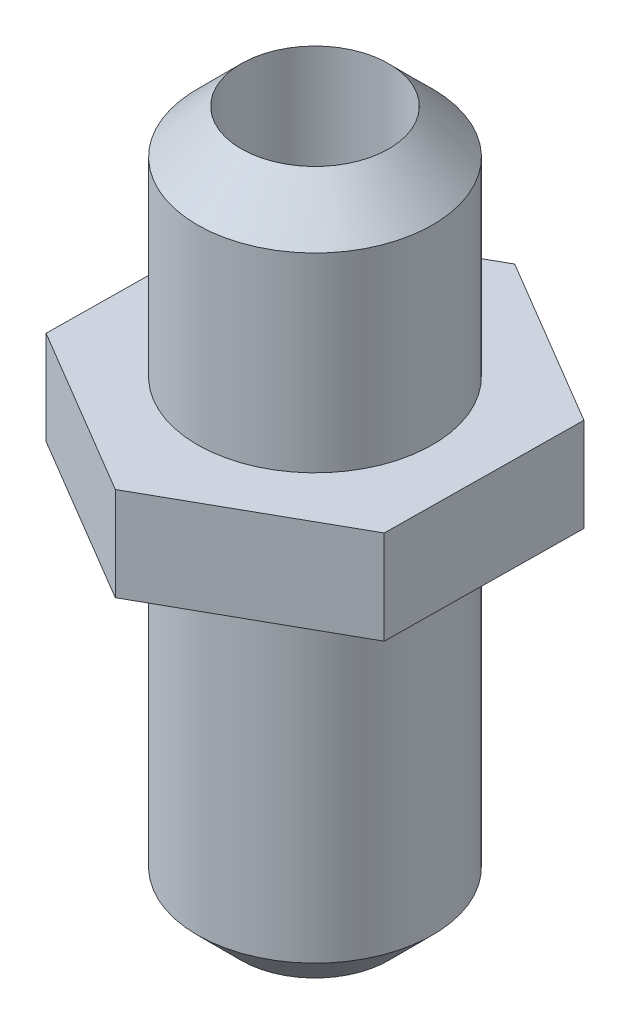
ISO-10303-21;
HEADER;
FILE_DESCRIPTION(('STEP AP214'),'2;1');
FILE_NAME('part.step','',(''),(''),'','','');
FILE_SCHEMA(('AUTOMOTIVE_DESIGN { 1 0 10303 214 1 1 1 1 }'));
ENDSEC;
DATA;
#1=APPLICATION_CONTEXT('core data for automotive mechanical design processes');
#2=APPLICATION_PROTOCOL_DEFINITION('international standard','automotive_design',2000,#1);
#3=PRODUCT_CONTEXT('',#1,'mechanical');
#4=PRODUCT('Part','Part','',(#3));
#5=PRODUCT_RELATED_PRODUCT_CATEGORY('part','',(#4));
#6=PRODUCT_DEFINITION_FORMATION('','',#4);
#7=PRODUCT_DEFINITION_CONTEXT('part definition',#1,'design');
#8=PRODUCT_DEFINITION('design','',#6,#7);
#9=PRODUCT_DEFINITION_SHAPE('','',#8);
#10=(LENGTH_UNIT() NAMED_UNIT(*) SI_UNIT(.MILLI.,.METRE.));
#11=(NAMED_UNIT(*) PLANE_ANGLE_UNIT() SI_UNIT($,.RADIAN.));
#12=(NAMED_UNIT(*) SI_UNIT($,.STERADIAN.) SOLID_ANGLE_UNIT());
#13=UNCERTAINTY_MEASURE_WITH_UNIT(LENGTH_MEASURE(1.E-05),#10,'distance_accuracy_value','');
#14=(GEOMETRIC_REPRESENTATION_CONTEXT(3) GLOBAL_UNCERTAINTY_ASSIGNED_CONTEXT((#13)) GLOBAL_UNIT_ASSIGNED_CONTEXT((#10,
#11,#12)) REPRESENTATION_CONTEXT('',''));
#15=CARTESIAN_POINT('',(0.,0.,0.));
#16=DIRECTION('',(0.,0.,1.));
#17=DIRECTION('',(1.,0.,0.));
#18=AXIS2_PLACEMENT_3D('',#15,#16,#17);
#19=CARTESIAN_POINT('',(4.54424241698549,5.08,8.08092209191937));
#20=DIRECTION('',(-0.490156662386525,0.,-0.871634353566966));
#21=DIRECTION('',(-0.871634353566966,0.,0.490156662386525));
#22=AXIS2_PLACEMENT_3D('',#19,#20,#21);
#23=PLANE('',#22);
#24=DIRECTION('',(0.871634353566966,0.,-0.490156662386525));
#25=VECTOR('',#24,1.);
#26=CARTESIAN_POINT('',(4.54424241698549,0.,8.08092209191937));
#27=LINE('',#26,#25);
#28=CARTESIAN_POINT('',(-0.121280128084548,0.,10.7045416746289));
#29=VERTEX_POINT('',#28);
#30=CARTESIAN_POINT('',(9.20976496205554,0.,5.45730250920989));
#31=VERTEX_POINT('',#30);
#32=EDGE_CURVE('E152',#29,#31,#27,.T.);
#33=ORIENTED_EDGE('',*,*,#32,.T.);
#34=DIRECTION('',(0.,-1.,0.));
#35=VECTOR('',#34,1.);
#36=CARTESIAN_POINT('',(9.20976496205554,5.08,5.45730250920989));
#37=LINE('',#36,#35);
#38=CARTESIAN_POINT('',(9.20976496205554,5.08,5.45730250920989));
#39=VERTEX_POINT('',#38);
#40=EDGE_CURVE('E164',#39,#31,#37,.T.);
#41=ORIENTED_EDGE('',*,*,#40,.F.);
#42=DIRECTION('',(0.871634353566966,0.,-0.490156662386525));
#43=VECTOR('',#42,1.);
#44=CARTESIAN_POINT('',(4.54424241698549,5.08,8.08092209191937));
#45=LINE('',#44,#43);
#46=CARTESIAN_POINT('',(-0.121280128084548,5.08,10.7045416746289));
#47=VERTEX_POINT('',#46);
#48=EDGE_CURVE('E118',#47,#39,#45,.T.);
#49=ORIENTED_EDGE('',*,*,#48,.F.);
#50=DIRECTION('',(0.,-1.,0.));
#51=VECTOR('',#50,1.);
#52=CARTESIAN_POINT('',(-0.121280128084548,5.08,10.7045416746289));
#53=LINE('',#52,#51);
#54=EDGE_CURVE('E167',#47,#29,#53,.T.);
#55=ORIENTED_EDGE('',*,*,#54,.T.);
#56=EDGE_LOOP('',(#33,#41,#49,#55));
#57=FACE_BOUND('',#56,.T.);
#58=ADVANCED_FACE('F62',(#57),#23,.F.);
#59=CARTESIAN_POINT('',(9.27040502609781,5.08,0.105031671895452));
#60=DIRECTION('',(-0.999935824193482,0.,-0.0113290553225598));
#61=DIRECTION('',(-0.0113290553225598,0.,0.999935824193482));
#62=AXIS2_PLACEMENT_3D('',#59,#60,#61);
#63=PLANE('',#62);
#64=DIRECTION('',(0.0113290553225598,0.,-0.999935824193482));
#65=VECTOR('',#64,1.);
#66=CARTESIAN_POINT('',(9.27040502609781,0.,0.105031671895452));
#67=LINE('',#66,#65);
#68=CARTESIAN_POINT('',(9.33104509014009,0.,-5.24723916541898));
#69=VERTEX_POINT('',#68);
#70=EDGE_CURVE('E155',#31,#69,#67,.T.);
#71=ORIENTED_EDGE('',*,*,#70,.T.);
#72=DIRECTION('',(0.,-1.,0.));
#73=VECTOR('',#72,1.);
#74=CARTESIAN_POINT('',(9.33104509014009,5.08,-5.24723916541898));
#75=LINE('',#74,#73);
#76=CARTESIAN_POINT('',(9.33104509014009,5.08,-5.24723916541898));
#77=VERTEX_POINT('',#76);
#78=EDGE_CURVE('E140',#77,#69,#75,.T.);
#79=ORIENTED_EDGE('',*,*,#78,.F.);
#80=DIRECTION('',(0.0113290553225598,0.,-0.999935824193482));
#81=VECTOR('',#80,1.);
#82=CARTESIAN_POINT('',(9.27040502609781,5.08,0.105031671895452));
#83=LINE('',#82,#81);
#84=EDGE_CURVE('E131',#39,#77,#83,.T.);
#85=ORIENTED_EDGE('',*,*,#84,.F.);
#86=ORIENTED_EDGE('',*,*,#40,.T.);
#87=EDGE_LOOP('',(#71,#79,#85,#86));
#88=FACE_BOUND('',#87,.T.);
#89=ADVANCED_FACE('F197',(#88),#63,.F.);
#90=CARTESIAN_POINT('',(4.72616260911232,5.08,-7.97589042002392));
#91=DIRECTION('',(-0.509779161806957,0.,0.860305298244406));
#92=DIRECTION('',(0.860305298244406,0.,0.509779161806957));
#93=AXIS2_PLACEMENT_3D('',#90,#91,#92);
#94=PLANE('',#93);
#95=DIRECTION('',(-0.860305298244406,0.,-0.509779161806957));
#96=VECTOR('',#95,1.);
#97=CARTESIAN_POINT('',(4.72616260911232,0.,-7.97589042002392));
#98=LINE('',#97,#96);
#99=CARTESIAN_POINT('',(0.121280128084553,0.,-10.7045416746289));
#100=VERTEX_POINT('',#99);
#101=EDGE_CURVE('E139',#69,#100,#98,.T.);
#102=ORIENTED_EDGE('',*,*,#101,.T.);
#103=DIRECTION('',(0.,-1.,0.));
#104=VECTOR('',#103,1.);
#105=CARTESIAN_POINT('',(0.121280128084553,5.08,-10.7045416746289));
#106=LINE('',#105,#104);
#107=CARTESIAN_POINT('',(0.121280128084553,5.08,-10.7045416746289));
#108=VERTEX_POINT('',#107);
#109=EDGE_CURVE('E136',#108,#100,#106,.T.);
#110=ORIENTED_EDGE('',*,*,#109,.F.);
#111=DIRECTION('',(-0.860305298244406,0.,-0.509779161806957));
#112=VECTOR('',#111,1.);
#113=CARTESIAN_POINT('',(4.72616260911232,5.08,-7.97589042002392));
#114=LINE('',#113,#112);
#115=EDGE_CURVE('E125',#77,#108,#114,.T.);
#116=ORIENTED_EDGE('',*,*,#115,.F.);
#117=ORIENTED_EDGE('',*,*,#78,.T.);
#118=EDGE_LOOP('',(#102,#110,#116,#117));
#119=FACE_BOUND('',#118,.T.);
#120=ADVANCED_FACE('F137',(#119),#94,.F.);
#121=CARTESIAN_POINT('',(-4.54424241698549,5.08,-8.08092209191937));
#122=DIRECTION('',(0.490156662386525,0.,0.871634353566966));
#123=DIRECTION('',(0.871634353566966,0.,-0.490156662386525));
#124=AXIS2_PLACEMENT_3D('',#121,#122,#123);
#125=PLANE('',#124);
#126=DIRECTION('',(-0.871634353566966,0.,0.490156662386525));
#127=VECTOR('',#126,1.);
#128=CARTESIAN_POINT('',(-4.54424241698549,0.,-8.08092209191937));
#129=LINE('',#128,#127);
#130=CARTESIAN_POINT('',(-9.20976496205553,0.,-5.45730250920989));
#131=VERTEX_POINT('',#130);
#132=EDGE_CURVE('E103',#100,#131,#129,.T.);
#133=ORIENTED_EDGE('',*,*,#132,.T.);
#134=DIRECTION('',(0.,-1.,0.));
#135=VECTOR('',#134,1.);
#136=CARTESIAN_POINT('',(-9.20976496205553,5.08,-5.45730250920989));
#137=LINE('',#136,#135);
#138=CARTESIAN_POINT('',(-9.20976496205553,5.08,-5.45730250920989));
#139=VERTEX_POINT('',#138);
#140=EDGE_CURVE('E141',#139,#131,#137,.T.);
#141=ORIENTED_EDGE('',*,*,#140,.F.);
#142=DIRECTION('',(-0.871634353566966,0.,0.490156662386525));
#143=VECTOR('',#142,1.);
#144=CARTESIAN_POINT('',(-4.54424241698549,5.08,-8.08092209191937));
#145=LINE('',#144,#143);
#146=EDGE_CURVE('E129',#108,#139,#145,.T.);
#147=ORIENTED_EDGE('',*,*,#146,.F.);
#148=ORIENTED_EDGE('',*,*,#109,.T.);
#149=EDGE_LOOP('',(#133,#141,#147,#148));
#150=FACE_BOUND('',#149,.T.);
#151=ADVANCED_FACE('F143',(#150),#125,.F.);
#152=CARTESIAN_POINT('',(-9.27040502609781,5.08,-0.10503167189545));
#153=DIRECTION('',(0.999935824193482,0.,0.0113290553225596));
#154=DIRECTION('',(0.0113290553225596,0.,-0.999935824193482));
#155=AXIS2_PLACEMENT_3D('',#152,#153,#154);
#156=PLANE('',#155);
#157=DIRECTION('',(-0.0113290553225596,0.,0.999935824193482));
#158=VECTOR('',#157,1.);
#159=CARTESIAN_POINT('',(-9.27040502609781,0.,-0.10503167189545));
#160=LINE('',#159,#158);
#161=CARTESIAN_POINT('',(-9.33104509014008,0.,5.24723916541898));
#162=VERTEX_POINT('',#161);
#163=EDGE_CURVE('E109',#131,#162,#160,.T.);
#164=ORIENTED_EDGE('',*,*,#163,.T.);
#165=DIRECTION('',(0.,-1.,0.));
#166=VECTOR('',#165,1.);
#167=CARTESIAN_POINT('',(-9.33104509014008,5.08,5.24723916541898));
#168=LINE('',#167,#166);
#169=CARTESIAN_POINT('',(-9.33104509014008,5.08,5.24723916541898));
#170=VERTEX_POINT('',#169);
#171=EDGE_CURVE('E145',#170,#162,#168,.T.);
#172=ORIENTED_EDGE('',*,*,#171,.F.);
#173=DIRECTION('',(-0.0113290553225596,0.,0.999935824193482));
#174=VECTOR('',#173,1.);
#175=CARTESIAN_POINT('',(-9.27040502609781,5.08,-0.10503167189545));
#176=LINE('',#175,#174);
#177=EDGE_CURVE('E80',#139,#170,#176,.T.);
#178=ORIENTED_EDGE('',*,*,#177,.F.);
#179=ORIENTED_EDGE('',*,*,#140,.T.);
#180=EDGE_LOOP('',(#164,#172,#178,#179));
#181=FACE_BOUND('',#180,.T.);
#182=ADVANCED_FACE('F203',(#181),#156,.F.);
#183=CARTESIAN_POINT('',(-4.72616260911232,5.08,7.97589042002392));
#184=DIRECTION('',(0.509779161806957,0.,-0.860305298244406));
#185=DIRECTION('',(-0.860305298244406,0.,-0.509779161806957));
#186=AXIS2_PLACEMENT_3D('',#183,#184,#185);
#187=PLANE('',#186);
#188=DIRECTION('',(0.860305298244406,0.,0.509779161806957));
#189=VECTOR('',#188,1.);
#190=CARTESIAN_POINT('',(-4.72616260911232,0.,7.97589042002392));
#191=LINE('',#190,#189);
#192=EDGE_CURVE('E149',#162,#29,#191,.T.);
#193=ORIENTED_EDGE('',*,*,#192,.T.);
#194=ORIENTED_EDGE('',*,*,#54,.F.);
#195=DIRECTION('',(0.860305298244406,0.,0.509779161806957));
#196=VECTOR('',#195,1.);
#197=CARTESIAN_POINT('',(-4.72616260911232,5.08,7.97589042002392));
#198=LINE('',#197,#196);
#199=EDGE_CURVE('E160',#170,#47,#198,.T.);
#200=ORIENTED_EDGE('',*,*,#199,.F.);
#201=ORIENTED_EDGE('',*,*,#171,.T.);
#202=EDGE_LOOP('',(#193,#194,#200,#201));
#203=FACE_BOUND('',#202,.T.);
#204=ADVANCED_FACE('F202',(#203),#187,.F.);
#205=CARTESIAN_POINT('',(0.,0.,0.));
#206=DIRECTION('',(0.,1.,0.));
#207=DIRECTION('',(0.,0.,1.));
#208=AXIS2_PLACEMENT_3D('',#205,#206,#207);
#209=PLANE('',#208);
#210=CARTESIAN_POINT('',(0.,0.,0.));
#211=DIRECTION('',(0.,1.,0.));
#212=DIRECTION('',(0.,0.,1.));
#213=AXIS2_PLACEMENT_3D('',#210,#211,#212);
#214=CIRCLE('',#213,6.38048);
#215=CARTESIAN_POINT('',(0.,0.,6.38048));
#216=VERTEX_POINT('',#215);
#217=EDGE_CURVE('E171',#216,#216,#214,.T.);
#218=ORIENTED_EDGE('',*,*,#217,.T.);
#219=EDGE_LOOP('',(#218));
#220=FACE_BOUND('',#219,.T.);
#221=ORIENTED_EDGE('',*,*,#192,.F.);
#222=ORIENTED_EDGE('',*,*,#163,.F.);
#223=ORIENTED_EDGE('',*,*,#132,.F.);
#224=ORIENTED_EDGE('',*,*,#101,.F.);
#225=ORIENTED_EDGE('',*,*,#70,.F.);
#226=ORIENTED_EDGE('',*,*,#32,.F.);
#227=EDGE_LOOP('',(#221,#222,#223,#224,#225,#226));
#228=FACE_BOUND('',#227,.T.);
#229=ADVANCED_FACE('F200',(#220,#228),#209,.F.);
#230=CARTESIAN_POINT('',(0.,5.08,0.));
#231=DIRECTION('',(0.,1.,0.));
#232=DIRECTION('',(0.,0.,1.));
#233=AXIS2_PLACEMENT_3D('',#230,#231,#232);
#234=PLANE('',#233);
#235=CARTESIAN_POINT('',(0.,5.08,0.));
#236=DIRECTION('',(0.,1.,0.));
#237=DIRECTION('',(0.,0.,1.));
#238=AXIS2_PLACEMENT_3D('',#235,#236,#237);
#239=CIRCLE('',#238,6.38048);
#240=CARTESIAN_POINT('',(0.,5.08,6.38048));
#241=VERTEX_POINT('',#240);
#242=EDGE_CURVE('E153',#241,#241,#239,.F.);
#243=ORIENTED_EDGE('',*,*,#242,.T.);
#244=EDGE_LOOP('',(#243));
#245=FACE_BOUND('',#244,.T.);
#246=ORIENTED_EDGE('',*,*,#199,.T.);
#247=ORIENTED_EDGE('',*,*,#48,.T.);
#248=ORIENTED_EDGE('',*,*,#84,.T.);
#249=ORIENTED_EDGE('',*,*,#115,.T.);
#250=ORIENTED_EDGE('',*,*,#146,.T.);
#251=ORIENTED_EDGE('',*,*,#177,.T.);
#252=EDGE_LOOP('',(#246,#247,#248,#249,#250,#251));
#253=FACE_BOUND('',#252,.T.);
#254=ADVANCED_FACE('F127',(#245,#253),#234,.T.);
#255=CARTESIAN_POINT('',(0.,17.78,0.));
#256=DIRECTION('',(0.,-1.,0.));
#257=DIRECTION('',(0.,0.,-1.));
#258=AXIS2_PLACEMENT_3D('',#255,#256,#257);
#259=CYLINDRICAL_SURFACE('',#258,6.38048);
#260=CARTESIAN_POINT('',(0.,15.4,0.));
#261=DIRECTION('',(0.,1.,0.));
#262=DIRECTION('',(0.,0.,1.));
#263=AXIS2_PLACEMENT_3D('',#260,#261,#262);
#264=CIRCLE('',#263,6.38048);
#265=CARTESIAN_POINT('',(0.,15.4,6.38048));
#266=VERTEX_POINT('',#265);
#267=EDGE_CURVE('E72',#266,#266,#264,.F.);
#268=ORIENTED_EDGE('',*,*,#267,.T.);
#269=EDGE_LOOP('',(#268));
#270=FACE_BOUND('',#269,.T.);
#271=ORIENTED_EDGE('',*,*,#242,.F.);
#272=EDGE_LOOP('',(#271));
#273=FACE_BOUND('',#272,.T.);
#274=ADVANCED_FACE('F178',(#270,#273),#259,.T.);
#275=CARTESIAN_POINT('',(0.,-20.32,0.));
#276=DIRECTION('',(0.,1.,0.));
#277=DIRECTION('',(0.,0.,1.));
#278=AXIS2_PLACEMENT_3D('',#275,#276,#277);
#279=CYLINDRICAL_SURFACE('',#278,6.38048);
#280=CARTESIAN_POINT('',(0.,-17.94,0.));
#281=DIRECTION('',(0.,1.,0.));
#282=DIRECTION('',(0.,0.,1.));
#283=AXIS2_PLACEMENT_3D('',#280,#281,#282);
#284=CIRCLE('',#283,6.38048);
#285=CARTESIAN_POINT('',(0.,-17.94,6.38048));
#286=VERTEX_POINT('',#285);
#287=EDGE_CURVE('E12',#286,#286,#284,.T.);
#288=ORIENTED_EDGE('',*,*,#287,.T.);
#289=EDGE_LOOP('',(#288));
#290=FACE_BOUND('',#289,.T.);
#291=ORIENTED_EDGE('',*,*,#217,.F.);
#292=EDGE_LOOP('',(#291));
#293=FACE_BOUND('',#292,.T.);
#294=ADVANCED_FACE('F272',(#290,#293),#279,.T.);
#295=CARTESIAN_POINT('',(0.,-32.512,0.));
#296=DIRECTION('',(0.,1.,0.));
#297=DIRECTION('',(0.,0.,1.));
#298=AXIS2_PLACEMENT_3D('',#295,#296,#297);
#299=CYLINDRICAL_SURFACE('',#298,4.00047968);
#300=CARTESIAN_POINT('',(0.,17.78,0.));
#301=DIRECTION('',(0.,1.,0.));
#302=DIRECTION('',(0.,0.,1.));
#303=AXIS2_PLACEMENT_3D('',#300,#301,#302);
#304=CIRCLE('',#303,4.00047968);
#305=CARTESIAN_POINT('',(0.,17.78,4.00047968));
#306=VERTEX_POINT('',#305);
#307=EDGE_CURVE('E174',#306,#306,#304,.T.);
#308=ORIENTED_EDGE('',*,*,#307,.T.);
#309=EDGE_LOOP('',(#308));
#310=FACE_BOUND('',#309,.T.);
#311=CARTESIAN_POINT('',(0.,-20.32,0.));
#312=DIRECTION('',(0.,1.,0.));
#313=DIRECTION('',(0.,0.,1.));
#314=AXIS2_PLACEMENT_3D('',#311,#312,#313);
#315=CIRCLE('',#314,4.00047968);
#316=CARTESIAN_POINT('',(0.,-20.32,4.00047968));
#317=VERTEX_POINT('',#316);
#318=EDGE_CURVE('E172',#317,#317,#315,.T.);
#319=ORIENTED_EDGE('',*,*,#318,.F.);
#320=EDGE_LOOP('',(#319));
#321=FACE_BOUND('',#320,.T.);
#322=ADVANCED_FACE('F184',(#310,#321),#299,.F.);
#323=CARTESIAN_POINT('',(0.,17.78,0.));
#324=DIRECTION('',(0.,-1.,0.));
#325=DIRECTION('',(0.,0.,-1.));
#326=AXIS2_PLACEMENT_3D('',#323,#324,#325);
#327=CONICAL_SURFACE('',#326,4.00048000000001,0.785398163397446);
#328=ORIENTED_EDGE('',*,*,#267,.F.);
#329=EDGE_LOOP('',(#328));
#330=FACE_BOUND('',#329,.T.);
#331=ORIENTED_EDGE('',*,*,#307,.F.);
#332=EDGE_LOOP('',(#331));
#333=FACE_BOUND('',#332,.T.);
#334=ADVANCED_FACE('F181',(#330,#333),#327,.T.);
#335=CARTESIAN_POINT('',(0.,-17.94,0.));
#336=DIRECTION('',(0.,1.,0.));
#337=DIRECTION('',(0.,0.,1.));
#338=AXIS2_PLACEMENT_3D('',#335,#336,#337);
#339=CONICAL_SURFACE('',#338,6.38048,0.785398163397449);
#340=ORIENTED_EDGE('',*,*,#318,.T.);
#341=EDGE_LOOP('',(#340));
#342=FACE_BOUND('',#341,.T.);
#343=ORIENTED_EDGE('',*,*,#287,.F.);
#344=EDGE_LOOP('',(#343));
#345=FACE_BOUND('',#344,.T.);
#346=ADVANCED_FACE('F65',(#342,#345),#339,.T.);
#347=CLOSED_SHELL('',(#58,#89,#120,#151,#182,#204,#229,#254,#274,#294,#322,#334,#346));
#348=MANIFOLD_SOLID_BREP('B2',#347);
#349=ADVANCED_BREP_SHAPE_REPRESENTATION('',(#18,#348),#14);
#350=SHAPE_DEFINITION_REPRESENTATION(#9,#349);
ENDSEC;
END-ISO-10303-21;
